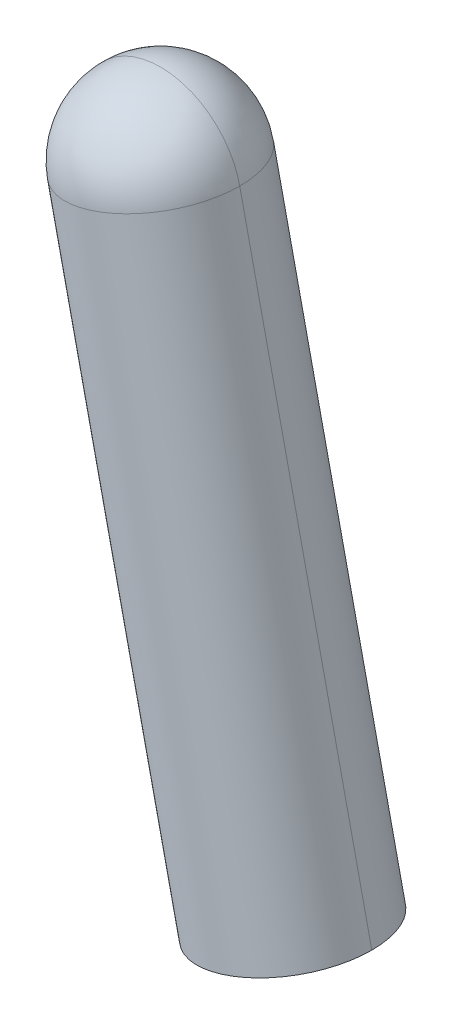
ISO-10303-21;
HEADER;
FILE_DESCRIPTION(('STEP AP214'),'2;1');
FILE_NAME('part.step','',(''),(''),'','','');
FILE_SCHEMA(('AUTOMOTIVE_DESIGN { 1 0 10303 214 1 1 1 1 }'));
ENDSEC;
DATA;
#1=APPLICATION_CONTEXT('core data for automotive mechanical design processes');
#2=APPLICATION_PROTOCOL_DEFINITION('international standard','automotive_design',2000,#1);
#3=PRODUCT_CONTEXT('',#1,'mechanical');
#4=PRODUCT('Part','Part','',(#3));
#5=PRODUCT_RELATED_PRODUCT_CATEGORY('part','',(#4));
#6=PRODUCT_DEFINITION_FORMATION('','',#4);
#7=PRODUCT_DEFINITION_CONTEXT('part definition',#1,'design');
#8=PRODUCT_DEFINITION('design','',#6,#7);
#9=PRODUCT_DEFINITION_SHAPE('','',#8);
#10=(LENGTH_UNIT() NAMED_UNIT(*) SI_UNIT(.MILLI.,.METRE.));
#11=(NAMED_UNIT(*) PLANE_ANGLE_UNIT() SI_UNIT($,.RADIAN.));
#12=(NAMED_UNIT(*) SI_UNIT($,.STERADIAN.) SOLID_ANGLE_UNIT());
#13=UNCERTAINTY_MEASURE_WITH_UNIT(LENGTH_MEASURE(1.E-05),#10,'distance_accuracy_value','');
#14=(GEOMETRIC_REPRESENTATION_CONTEXT(3) GLOBAL_UNCERTAINTY_ASSIGNED_CONTEXT((#13)) GLOBAL_UNIT_ASSIGNED_CONTEXT((#10,
#11,#12)) REPRESENTATION_CONTEXT('',''));
#15=CARTESIAN_POINT('',(0.,0.,0.));
#16=DIRECTION('',(0.,0.,1.));
#17=DIRECTION('',(1.,0.,0.));
#18=AXIS2_PLACEMENT_3D('',#15,#16,#17);
#19=CARTESIAN_POINT('',(0.824634929104171,-7.52968778712689,0.));
#20=DIRECTION('',(-0.216439613938102,0.976296007119934,0.));
#21=DIRECTION('',(0.,0.,-1.));
#22=AXIS2_PLACEMENT_3D('',#19,#20,#21);
#23=CYLINDRICAL_SURFACE('',#22,2.9972);
#24=CARTESIAN_POINT('',(0.824634929104186,-7.52968778712697,0.));
#25=DIRECTION('',(0.216439613938102,-0.976296007119934,0.));
#26=DIRECTION('',(0.976296007119934,0.216439613938102,0.));
#27=AXIS2_PLACEMENT_3D('',#24,#25,#26);
#28=CIRCLE('',#27,2.9972);
#29=CARTESIAN_POINT('',(3.750789321644,-6.88097497623169,0.));
#30=VERTEX_POINT('',#29);
#31=CARTESIAN_POINT('',(-2.10151946343568,-8.17840059802225,0.));
#32=VERTEX_POINT('',#31);
#33=EDGE_CURVE('E11',#30,#32,#28,.T.);
#34=ORIENTED_EDGE('',*,*,#33,.F.);
#35=DIRECTION('',(-0.216439613938102,0.976296007119934,0.));
#36=VECTOR('',#35,1.);
#37=CARTESIAN_POINT('',(3.75078932164405,-6.88097497623169,0.));
#38=LINE('',#37,#36);
#39=CARTESIAN_POINT('',(-1.1338286423054,15.152112810895,0.));
#40=VERTEX_POINT('',#39);
#41=EDGE_CURVE('E25',#30,#40,#38,.T.);
#42=ORIENTED_EDGE('',*,*,#41,.T.);
#43=CARTESIAN_POINT('',(-4.05998303484515,14.5033999999997,0.));
#44=DIRECTION('',(0.216439613938102,-0.976296007119934,0.));
#45=DIRECTION('',(0.976296007119934,0.216439613938102,0.));
#46=AXIS2_PLACEMENT_3D('',#43,#44,#45);
#47=CIRCLE('',#46,2.9972);
#48=CARTESIAN_POINT('',(-6.986137427385,13.8546871891045,0.));
#49=VERTEX_POINT('',#48);
#50=EDGE_CURVE('E59',#40,#49,#47,.T.);
#51=ORIENTED_EDGE('',*,*,#50,.T.);
#52=DIRECTION('',(-0.216439613938102,0.976296007119934,0.));
#53=VECTOR('',#52,1.);
#54=CARTESIAN_POINT('',(-2.10151946343568,-8.17840059802225,0.));
#55=LINE('',#54,#53);
#56=EDGE_CURVE('E102',#32,#49,#55,.T.);
#57=ORIENTED_EDGE('',*,*,#56,.F.);
#58=EDGE_LOOP('',(#34,#42,#51,#57));
#59=FACE_BOUND('',#58,.T.);
#60=ADVANCED_FACE('F17',(#59),#23,.T.);
#61=CARTESIAN_POINT('',(0.824634929104171,-7.52968778712689,0.));
#62=DIRECTION('',(-0.216439613938102,0.976296007119934,0.));
#63=DIRECTION('',(0.,0.,1.));
#64=AXIS2_PLACEMENT_3D('',#61,#62,#63);
#65=CYLINDRICAL_SURFACE('',#64,2.9972);
#66=CARTESIAN_POINT('',(-4.05998303484515,14.5033999999997,0.));
#67=DIRECTION('',(0.216439613938102,-0.976296007119934,0.));
#68=DIRECTION('',(0.976296007119934,0.216439613938102,0.));
#69=AXIS2_PLACEMENT_3D('',#66,#67,#68);
#70=CIRCLE('',#69,2.9972);
#71=EDGE_CURVE('E52',#49,#40,#70,.T.);
#72=ORIENTED_EDGE('',*,*,#71,.T.);
#73=ORIENTED_EDGE('',*,*,#41,.F.);
#74=CARTESIAN_POINT('',(0.824634929104186,-7.52968778712697,0.));
#75=DIRECTION('',(0.216439613938102,-0.976296007119934,0.));
#76=DIRECTION('',(0.976296007119934,0.216439613938102,0.));
#77=AXIS2_PLACEMENT_3D('',#74,#75,#76);
#78=CIRCLE('',#77,2.9972);
#79=EDGE_CURVE('E60',#32,#30,#78,.T.);
#80=ORIENTED_EDGE('',*,*,#79,.F.);
#81=ORIENTED_EDGE('',*,*,#56,.T.);
#82=EDGE_LOOP('',(#72,#73,#80,#81));
#83=FACE_BOUND('',#82,.T.);
#84=ADVANCED_FACE('F116',(#83),#65,.T.);
#85=CARTESIAN_POINT('',(3.750789321644,-6.88097497623167,0.));
#86=DIRECTION('',(-0.216439613938102,0.976296007119934,0.));
#87=DIRECTION('',(-0.976296007119934,-0.216439613938102,0.));
#88=AXIS2_PLACEMENT_3D('',#85,#86,#87);
#89=PLANE('',#88);
#90=ORIENTED_EDGE('',*,*,#33,.T.);
#91=ORIENTED_EDGE('',*,*,#79,.T.);
#92=EDGE_LOOP('',(#90,#91));
#93=FACE_BOUND('',#92,.T.);
#94=ADVANCED_FACE('F80',(#93),#89,.F.);
#95=CARTESIAN_POINT('',(-4.05998303484593,14.5033999999992,0.));
#96=DIRECTION('',(0.216439613938102,-0.976296007119934,0.));
#97=DIRECTION('',(0.,0.,1.));
#98=AXIS2_PLACEMENT_3D('',#95,#96,#97);
#99=SPHERICAL_SURFACE('',#98,2.9972);
#100=CARTESIAN_POINT('',(-4.70869584574122,17.429554392539,0.));
#101=CARTESIAN_POINT('',(-4.66081693326622,17.4401699574402,0.));
#102=CARTESIAN_POINT('',(-4.61267714493441,17.4496083784185,0.));
#103=CARTESIAN_POINT('',(-4.5159925590363,17.4661127023011,0.));
#104=CARTESIAN_POINT('',(-4.46744776146999,17.4731786052055,0.));
#105=CARTESIAN_POINT('',(-4.370069899582,17.4849196627119,0.));
#106=CARTESIAN_POINT('',(-4.32123683526031,17.4895948173141,0.));
#107=CARTESIAN_POINT('',(-4.22340013823928,17.4965434390015,0.));
#108=CARTESIAN_POINT('',(-4.17439650553994,17.4988169060868,0.));
#109=CARTESIAN_POINT('',(-4.0763367110032,17.5009565890394,0.));
#110=CARTESIAN_POINT('',(-4.0272805491658,17.5008228049067,0.));
#111=CARTESIAN_POINT('',(-3.92923388091028,17.4981483309577,0.));
#112=CARTESIAN_POINT('',(-3.88024337449216,17.4956076411413,0.));
#113=CARTESIAN_POINT('',(-3.78244603843337,17.4881254703429,0.));
#114=CARTESIAN_POINT('',(-3.73363920879269,17.4831839893609,0.));
#115=CARTESIAN_POINT('',(-3.63632680650114,17.4709121423601,0.));
#116=CARTESIAN_POINT('',(-3.58782123385028,17.4635817763412,0.));
#117=CARTESIAN_POINT('',(-3.49122819963515,17.4465498183135,0.));
#118=CARTESIAN_POINT('',(-3.44314073807088,17.4368482263047,0.));
#119=CARTESIAN_POINT('',(-3.34749977295628,17.4150971884016,0.));
#120=CARTESIAN_POINT('',(-3.29994626940594,17.4030477425074,0.));
#121=CARTESIAN_POINT('',(-3.20548778086896,17.376630024972,0.));
#122=CARTESIAN_POINT('',(-3.15858279588231,17.362261753331,0.));
#123=CARTESIAN_POINT('',(-3.0655343426914,17.3312409987354,0.));
#124=CARTESIAN_POINT('',(-3.01939087448714,17.3145885157809,0.));
#125=CARTESIAN_POINT('',(-2.9279766185172,17.2790394558463,0.));
#126=CARTESIAN_POINT('',(-2.88270583075152,17.2601428788662,0.));
#127=CARTESIAN_POINT('',(-2.79314599695184,17.22015115439,0.));
#128=CARTESIAN_POINT('',(-2.74885695091783,17.1990560068939,0.));
#129=CARTESIAN_POINT('',(-2.66136729677262,17.1547179614436,0.));
#130=CARTESIAN_POINT('',(-2.61816668866142,17.1314750634894,0.));
#131=CARTESIAN_POINT('',(-2.53295798441069,17.0828975113,0.));
#132=CARTESIAN_POINT('',(-2.49094988827116,17.0575628570648,0.));
#133=CARTESIAN_POINT('',(-2.40822740914685,17.0048628257145,0.));
#134=CARTESIAN_POINT('',(-2.36751302616207,16.9774974485993,0.));
#135=CARTESIAN_POINT('',(-2.28747605786202,16.9208018970795,0.));
#136=CARTESIAN_POINT('',(-2.24815347254675,16.8914717226748,0.));
#137=CARTESIAN_POINT('',(-2.17099483113804,16.830917235535,0.));
#138=CARTESIAN_POINT('',(-2.1331587750446,16.7996929228,0.));
#139=CARTESIAN_POINT('',(-2.05906434245256,16.7354253811038,0.));
#140=CARTESIAN_POINT('',(-2.02280596595395,16.7023821521426,0.));
#141=CARTESIAN_POINT('',(-1.95195424215704,16.634556382027,0.));
#142=CARTESIAN_POINT('',(-1.91736089485874,16.5997738408725,0.));
#143=CARTESIAN_POINT('',(-1.84992256786381,16.5285532405589,0.));
#144=CARTESIAN_POINT('',(-1.8170775881672,16.4921151813999,0.));
#145=CARTESIAN_POINT('',(-1.75321512281705,16.417671327551,0.));
#146=CARTESIAN_POINT('',(-1.72219763716352,16.3796655328612,0.));
#147=CARTESIAN_POINT('',(-1.66206488370788,16.3021777672478,0.));
#148=CARTESIAN_POINT('',(-1.63294961590577,16.2626957963242,0.));
#149=CARTESIAN_POINT('',(-1.57669143950052,16.1823507937373,0.));
#150=CARTESIAN_POINT('',(-1.54954853089737,16.1414877620739,0.));
#151=CARTESIAN_POINT('',(-1.4973004620969,16.0584790807497,0.));
#152=CARTESIAN_POINT('',(-1.47219530189958,16.0163334310889,0.));
#153=CARTESIAN_POINT('',(-1.424083212073,15.9308610458842,0.));
#154=CARTESIAN_POINT('',(-1.40107628244374,15.8875343103404,0.));
#155=CARTESIAN_POINT('',(-1.35721607336988,15.7998041329389,0.));
#156=CARTESIAN_POINT('',(-1.33636279392529,15.7554006910811,0.));
#157=CARTESIAN_POINT('',(-1.29686014533325,15.6656240666071,0.));
#158=CARTESIAN_POINT('',(-1.27821077618582,15.6202508839909,0.));
#159=CARTESIAN_POINT('',(-1.2431607913008,15.5286441092038,0.));
#160=CARTESIAN_POINT('',(-1.22676017556321,15.4824105170329,0.));
#161=CARTESIAN_POINT('',(-1.19624752468624,15.3891942172044,0.));
#162=CARTESIAN_POINT('',(-1.18213548954684,15.3422115095469,0.));
#163=CARTESIAN_POINT('',(-1.15623281517205,15.2476104877905,0.));
#164=CARTESIAN_POINT('',(-1.14444217593665,15.1999921736917,0.));
#165=CARTESIAN_POINT('',(-1.13382864230616,15.1521128108948,0.));
#166=B_SPLINE_CURVE_WITH_KNOTS('',3,(#100,#101,#102,#103,#104,#105,#106,#107,#108,#109,#110,
#111,#112,#113,#114,#115,#116,#117,#118,#119,#120,#121,#122,#123,#124,#125,#126,#127,#128,#129,
#130,#131,#132,#133,#134,#135,#136,#137,#138,#139,#140,#141,#142,#143,#144,#145,#146,#147,#148,
#149,#150,#151,#152,#153,#154,#155,#156,#157,#158,#159,#160,#161,#162,#163,#164,#165),
.UNSPECIFIED.,.F.,.F.,(4,2,2,2,2,2,2,2,2,2,2,2,2,2,2,2,2,2,2,2,2,2,2,2,2,2,2,2,2,2,2,2,4),(0.,
0.147109940257733,0.294219880515466,0.441329820773199,0.588439761030931,0.735549701288664,
0.882659641546397,1.02976958180413,1.17687952206186,1.3239894623196,1.47109940257733,
1.61820934283506,1.76531928309279,1.91242922335053,2.05953916360826,2.20664910386599,
2.35375904412373,2.50086898438146,2.64797892463919,2.79508886489692,2.94219880515466,
3.08930874541239,3.23641868567012,3.38352862592786,3.53063856618559,3.67774850644332,
3.82485844670105,3.97196838695879,4.11907832721652,4.26618826747425,4.41329820773199,
4.56040814798972,4.70751808824745),.UNSPECIFIED.);
#167=CARTESIAN_POINT('',(-4.70869584574121,17.429554392539,0.));
#168=VERTEX_POINT('',#167);
#169=EDGE_CURVE('E49',#168,#40,#166,.T.);
#170=ORIENTED_EDGE('',*,*,#169,.T.);
#171=ORIENTED_EDGE('',*,*,#71,.F.);
#172=CARTESIAN_POINT('',(-4.70869584574121,17.429554392539,0.));
#173=CARTESIAN_POINT('',(-4.75657520853808,17.4189408589085,0.));
#174=CARTESIAN_POINT('',(-4.80419352263692,17.4071502196731,0.));
#175=CARTESIAN_POINT('',(-4.89879454439328,17.3812475452984,0.));
#176=CARTESIAN_POINT('',(-4.94577725205079,17.367135510159,0.));
#177=CARTESIAN_POINT('',(-5.03899355187925,17.336622859282,0.));
#178=CARTESIAN_POINT('',(-5.08522714405018,17.3202222435444,0.));
#179=CARTESIAN_POINT('',(-5.17683391883731,17.2851722586594,0.));
#180=CARTESIAN_POINT('',(-5.22220710145351,17.266522889512,0.));
#181=CARTESIAN_POINT('',(-5.31198372592748,17.22702024092,0.));
#182=CARTESIAN_POINT('',(-5.35638716778526,17.2061669614754,0.));
#183=CARTESIAN_POINT('',(-5.44411734518682,17.1623067524015,0.));
#184=CARTESIAN_POINT('',(-5.48744408073061,17.1392998227723,0.));
#185=CARTESIAN_POINT('',(-5.57291646593527,17.0911877329457,0.));
#186=CARTESIAN_POINT('',(-5.61506211559615,17.0660825727484,0.));
#187=CARTESIAN_POINT('',(-5.69807079692037,17.013834503948,0.));
#188=CARTESIAN_POINT('',(-5.73893382858372,16.9866915953448,0.));
#189=CARTESIAN_POINT('',(-5.81927883117068,16.9304334189396,0.));
#190=CARTESIAN_POINT('',(-5.8587608020943,16.9013181511375,0.));
#191=CARTESIAN_POINT('',(-5.93624856770771,16.8411853976818,0.));
#192=CARTESIAN_POINT('',(-5.9742543623975,16.8101679120283,0.));
#193=CARTESIAN_POINT('',(-6.04869821624636,16.7463054466782,0.));
#194=CARTESIAN_POINT('',(-6.08513627540542,16.7134604669816,0.));
#195=CARTESIAN_POINT('',(-6.15635687571899,16.6460221399866,0.));
#196=CARTESIAN_POINT('',(-6.19113941687351,16.6114287926883,0.));
#197=CARTESIAN_POINT('',(-6.25896518698915,16.5405770688914,0.));
#198=CARTESIAN_POINT('',(-6.29200841595027,16.5043186923928,0.));
#199=CARTESIAN_POINT('',(-6.35627595764647,16.4302242598008,0.));
#200=CARTESIAN_POINT('',(-6.38750027038155,16.3923882037074,0.));
#201=CARTESIAN_POINT('',(-6.44805475752133,16.3152295622987,0.));
#202=CARTESIAN_POINT('',(-6.47738493192602,16.2759069769834,0.));
#203=CARTESIAN_POINT('',(-6.53408048344587,16.1958700086834,0.));
#204=CARTESIAN_POINT('',(-6.56144586056102,16.1551556256986,0.));
#205=CARTESIAN_POINT('',(-6.61414589191139,16.0724331465743,0.));
#206=CARTESIAN_POINT('',(-6.63948054614661,16.0304250504348,0.));
#207=CARTESIAN_POINT('',(-6.688058098336,15.945216346184,0.));
#208=CARTESIAN_POINT('',(-6.71130099629018,15.9020157380728,0.));
#209=CARTESIAN_POINT('',(-6.75563904174046,15.8145260839276,0.));
#210=CARTESIAN_POINT('',(-6.77673418923656,15.7702370378936,0.));
#211=CARTESIAN_POINT('',(-6.8167259137128,15.6806772040939,0.));
#212=CARTESIAN_POINT('',(-6.83562249069294,15.6354064163283,0.));
#213=CARTESIAN_POINT('',(-6.87117155062755,15.5439921603583,0.));
#214=CARTESIAN_POINT('',(-6.88782403358203,15.4978486921541,0.));
#215=CARTESIAN_POINT('',(-6.91884478817761,15.4048002389632,0.));
#216=CARTESIAN_POINT('',(-6.9332130598187,15.3578952539765,0.));
#217=CARTESIAN_POINT('',(-6.95963077735402,15.2634367654395,0.));
#218=CARTESIAN_POINT('',(-6.97168022324825,15.2158832618892,0.));
#219=CARTESIAN_POINT('',(-6.99343126115134,15.1202422967746,0.));
#220=CARTESIAN_POINT('',(-7.00313285316021,15.0721548352104,0.));
#221=CARTESIAN_POINT('',(-7.02016481118793,14.9755618009952,0.));
#222=CARTESIAN_POINT('',(-7.02749517720677,14.9270562283444,0.));
#223=CARTESIAN_POINT('',(-7.03976702420763,14.8297438260528,0.));
#224=CARTESIAN_POINT('',(-7.04470850518965,14.7809369964121,0.));
#225=CARTESIAN_POINT('',(-7.05219067598806,14.6831396603533,0.));
#226=CARTESIAN_POINT('',(-7.05473136580446,14.6341491539352,0.));
#227=CARTESIAN_POINT('',(-7.0574058397535,14.5361024856797,0.));
#228=CARTESIAN_POINT('',(-7.05753962388615,14.4870463238423,0.));
#229=CARTESIAN_POINT('',(-7.05539994093354,14.3889865293056,0.));
#230=CARTESIAN_POINT('',(-7.05312647384829,14.3399828966062,0.));
#231=CARTESIAN_POINT('',(-7.0461778521609,14.2421461995852,0.));
#232=CARTESIAN_POINT('',(-7.04150269755875,14.1933131352635,0.));
#233=CARTESIAN_POINT('',(-7.02976164005229,14.0959352733755,0.));
#234=CARTESIAN_POINT('',(-7.02269573714796,14.0473904758092,0.));
#235=CARTESIAN_POINT('',(-7.00619141326535,13.9507058899111,0.));
#236=CARTESIAN_POINT('',(-6.99675299228706,13.9025661015793,0.));
#237=CARTESIAN_POINT('',(-6.98613742738589,13.8546871891043,0.));
#238=B_SPLINE_CURVE_WITH_KNOTS('',3,(#172,#173,#174,#175,#176,#177,#178,#179,#180,#181,#182,
#183,#184,#185,#186,#187,#188,#189,#190,#191,#192,#193,#194,#195,#196,#197,#198,#199,#200,#201,
#202,#203,#204,#205,#206,#207,#208,#209,#210,#211,#212,#213,#214,#215,#216,#217,#218,#219,#220,
#221,#222,#223,#224,#225,#226,#227,#228,#229,#230,#231,#232,#233,#234,#235,#236,#237),
.UNSPECIFIED.,.F.,.F.,(4,2,2,2,2,2,2,2,2,2,2,2,2,2,2,2,2,2,2,2,2,2,2,2,2,2,2,2,2,2,2,2,4),(0.,
0.147109940257733,0.294219880515466,0.441329820773199,0.588439761030932,0.735549701288665,
0.882659641546398,1.02976958180413,1.17687952206186,1.3239894623196,1.47109940257733,
1.61820934283506,1.7653192830928,1.91242922335053,2.05953916360826,2.20664910386599,
2.35375904412372,2.50086898438146,2.64797892463919,2.79508886489692,2.94219880515466,
3.08930874541239,3.23641868567012,3.38352862592786,3.53063856618559,3.67774850644332,
3.82485844670106,3.97196838695879,4.11907832721652,4.26618826747425,4.41329820773199,
4.56040814798972,4.70751808824745),.UNSPECIFIED.);
#239=EDGE_CURVE('E45',#168,#49,#238,.T.);
#240=ORIENTED_EDGE('',*,*,#239,.F.);
#241=EDGE_LOOP('',(#170,#171,#240));
#242=FACE_BOUND('',#241,.T.);
#243=ADVANCED_FACE('F48',(#242),#99,.T.);
#244=CARTESIAN_POINT('',(-4.05998303484593,14.5033999999992,0.));
#245=DIRECTION('',(0.216439613938102,-0.976296007119934,0.));
#246=DIRECTION('',(0.,0.,-1.));
#247=AXIS2_PLACEMENT_3D('',#244,#245,#246);
#248=SPHERICAL_SURFACE('',#247,2.9972);
#249=ORIENTED_EDGE('',*,*,#239,.T.);
#250=ORIENTED_EDGE('',*,*,#50,.F.);
#251=ORIENTED_EDGE('',*,*,#169,.F.);
#252=EDGE_LOOP('',(#249,#250,#251));
#253=FACE_BOUND('',#252,.T.);
#254=ADVANCED_FACE('F58',(#253),#248,.T.);
#255=CLOSED_SHELL('',(#60,#84,#94,#243,#254));
#256=MANIFOLD_SOLID_BREP('B1',#255);
#257=ADVANCED_BREP_SHAPE_REPRESENTATION('',(#18,#256),#14);
#258=SHAPE_DEFINITION_REPRESENTATION(#9,#257);
ENDSEC;
END-ISO-10303-21;
